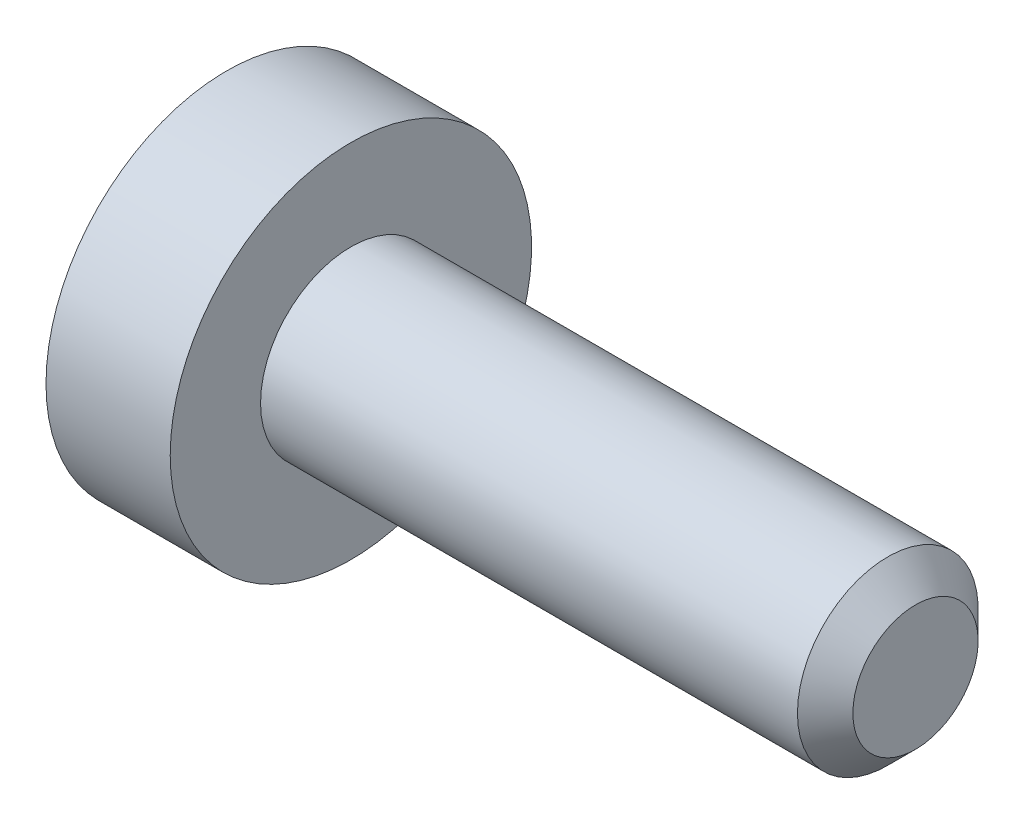
ISO-10303-21;
HEADER;
FILE_DESCRIPTION(('STEP AP214'),'2;1');
FILE_NAME('part.step','',(''),(''),'','','');
FILE_SCHEMA(('AUTOMOTIVE_DESIGN { 1 0 10303 214 1 1 1 1 }'));
ENDSEC;
DATA;
#1=APPLICATION_CONTEXT('core data for automotive mechanical design processes');
#2=APPLICATION_PROTOCOL_DEFINITION('international standard','automotive_design',2000,#1);
#3=PRODUCT_CONTEXT('',#1,'mechanical');
#4=PRODUCT('Part','Part','',(#3));
#5=PRODUCT_RELATED_PRODUCT_CATEGORY('part','',(#4));
#6=PRODUCT_DEFINITION_FORMATION('','',#4);
#7=PRODUCT_DEFINITION_CONTEXT('part definition',#1,'design');
#8=PRODUCT_DEFINITION('design','',#6,#7);
#9=PRODUCT_DEFINITION_SHAPE('','',#8);
#10=(LENGTH_UNIT() NAMED_UNIT(*) SI_UNIT(.MILLI.,.METRE.));
#11=(NAMED_UNIT(*) PLANE_ANGLE_UNIT() SI_UNIT($,.RADIAN.));
#12=(NAMED_UNIT(*) SI_UNIT($,.STERADIAN.) SOLID_ANGLE_UNIT());
#13=UNCERTAINTY_MEASURE_WITH_UNIT(LENGTH_MEASURE(1.E-05),#10,'distance_accuracy_value','');
#14=(GEOMETRIC_REPRESENTATION_CONTEXT(3) GLOBAL_UNCERTAINTY_ASSIGNED_CONTEXT((#13)) GLOBAL_UNIT_ASSIGNED_CONTEXT((#10,
#11,#12)) REPRESENTATION_CONTEXT('',''));
#15=CARTESIAN_POINT('',(0.,0.,0.));
#16=DIRECTION('',(0.,0.,1.));
#17=DIRECTION('',(1.,0.,0.));
#18=AXIS2_PLACEMENT_3D('',#15,#16,#17);
#19=CARTESIAN_POINT('',(-0.97,0.,0.));
#20=DIRECTION('',(-1.,0.,0.));
#21=DIRECTION('',(0.,0.,1.));
#22=AXIS2_PLACEMENT_3D('',#19,#20,#21);
#23=CONICAL_SURFACE('',#22,0.65,0.785398163397449);
#24=CARTESIAN_POINT('',(-1.1,0.,0.));
#25=DIRECTION('',(-1.,0.,0.));
#26=DIRECTION('',(0.,0.,1.));
#27=AXIS2_PLACEMENT_3D('',#24,#25,#26);
#28=CIRCLE('',#27,0.78);
#29=CARTESIAN_POINT('',(-1.1,0.,0.78));
#30=VERTEX_POINT('',#29);
#31=EDGE_CURVE('E227',#30,#30,#28,.T.);
#32=ORIENTED_EDGE('',*,*,#31,.T.);
#33=EDGE_LOOP('',(#32));
#34=FACE_BOUND('',#33,.T.);
#35=CARTESIAN_POINT('',(-1.07067084664318,0.750670820000348,-0.000200000000000034));
#36=CARTESIAN_POINT('',(-1.05777271213806,0.73776480399612,0.0221538754426204));
#37=CARTESIAN_POINT('',(-1.04563050484515,0.724643800275744,0.044880120532612));
#38=CARTESIAN_POINT('',(-1.02339759480874,0.697888312556701,0.0912219846432812));
#39=CARTESIAN_POINT('',(-1.01331927475652,0.684251279339144,0.114842019040595));
#40=CARTESIAN_POINT('',(-0.996056866369887,0.656751052753346,0.162473808706854));
#41=CARTESIAN_POINT('',(-0.988829308462092,0.642894902702,0.186473364593084));
#42=CARTESIAN_POINT('',(-0.97768455194652,0.614884150684731,0.234989410245206));
#43=CARTESIAN_POINT('',(-0.973759052568381,0.600730389323031,0.259504444041877));
#44=CARTESIAN_POINT('',(-0.96877878728122,0.566158679282904,0.319384402335916));
#45=CARTESIAN_POINT('',(-0.969679834739171,0.545659978891344,0.354889192903231));
#46=CARTESIAN_POINT('',(-0.978963911263182,0.505092254718528,0.42515455231799));
#47=CARTESIAN_POINT('',(-0.98735811297617,0.485023918403328,0.459913930439298));
#48=CARTESIAN_POINT('',(-1.00760102845381,0.449779956850421,0.520958262508936));
#49=CARTESIAN_POINT('',(-1.01839377321102,0.434442301170774,0.547523861415083));
#50=CARTESIAN_POINT('',(-1.04270728139612,0.404367956205631,0.599614154899066));
#51=CARTESIAN_POINT('',(-1.0562191709538,0.389629494831163,0.625141918825035));
#52=CARTESIAN_POINT('',(-1.07067084664319,0.375162204919422,0.6502));
#53=B_SPLINE_CURVE_WITH_KNOTS('',3,(#35,#36,#37,#38,#39,#40,#41,#42,#43,#44,#45,#46,#47,#48,#49,
#50,#51,#52),.UNSPECIFIED.,.F.,.F.,(4,2,2,2,2,2,2,2,4),(0.,0.0866236559063428,0.173752711623239,
0.259496442803563,0.345023980281746,0.467267720550118,0.589694037029328,0.687111308755475,
0.784215671813662),.UNSPECIFIED.);
#54=CARTESIAN_POINT('',(-1.07055534994651,0.75055534994651,0.));
#55=VERTEX_POINT('',#54);
#56=CARTESIAN_POINT('',(-1.07055534994651,0.37527767497326,0.65));
#57=VERTEX_POINT('',#56);
#58=EDGE_CURVE('E54',#55,#57,#53,.T.);
#59=ORIENTED_EDGE('',*,*,#58,.T.);
#60=CARTESIAN_POINT('',(-1.34698657134254,-0.795110946797934,0.65));
#61=CARTESIAN_POINT('',(-1.33215114259725,-0.775946306003986,0.65));
#62=CARTESIAN_POINT('',(-1.3174472939133,-0.756680121115909,0.65));
#63=CARTESIAN_POINT('',(-1.28835841074634,-0.717901876989154,0.65));
#64=CARTESIAN_POINT('',(-1.27397345032455,-0.6983897622505,0.65));
#65=CARTESIAN_POINT('',(-1.23117506241516,-0.639135200540149,0.65));
#66=CARTESIAN_POINT('',(-1.20334527350157,-0.598964394147309,0.65));
#67=CARTESIAN_POINT('',(-1.14826198934892,-0.514410757724497,0.65));
#68=CARTESIAN_POINT('',(-1.12116572431861,-0.46992440441247,0.65));
#69=CARTESIAN_POINT('',(-1.0712919728277,-0.378677329688828,0.65));
#70=CARTESIAN_POINT('',(-1.04849990079042,-0.331924989534033,0.65));
#71=CARTESIAN_POINT('',(-1.02060578904515,-0.262171836183639,0.65));
#72=CARTESIAN_POINT('',(-1.01268451768127,-0.240308902088551,0.65));
#73=CARTESIAN_POINT('',(-0.998588372872614,-0.196027368820283,0.65));
#74=CARTESIAN_POINT('',(-0.992413608004518,-0.173608735194612,0.65));
#75=CARTESIAN_POINT('',(-0.977262665972014,-0.106507355653642,0.65));
#76=CARTESIAN_POINT('',(-0.971270973089183,-0.0610734931701748,0.65));
#77=CARTESIAN_POINT('',(-0.96914985793265,0.0279224529824405,0.65));
#78=CARTESIAN_POINT('',(-0.972574981246003,0.0714733819315436,0.65));
#79=CARTESIAN_POINT('',(-0.983733142695104,0.136066508476408,0.65));
#80=CARTESIAN_POINT('',(-0.988531386792264,0.157677342437972,0.65));
#81=CARTESIAN_POINT('',(-0.999890236201741,0.20043000731548,0.65));
#82=CARTESIAN_POINT('',(-1.00645075830175,0.221571860325033,0.65));
#83=CARTESIAN_POINT('',(-1.02901876039986,0.286168508724034,0.65));
#84=CARTESIAN_POINT('',(-1.04751312457459,0.328748789016924,0.65));
#85=CARTESIAN_POINT('',(-1.08868123081028,0.411924938969468,0.65));
#86=CARTESIAN_POINT('',(-1.11136960894874,0.45251320906933,0.65));
#87=CARTESIAN_POINT('',(-1.15821231122604,0.530105416888655,0.65));
#88=CARTESIAN_POINT('',(-1.18223949226305,0.567187443274161,0.65));
#89=CARTESIAN_POINT('',(-1.23177090042578,0.639922078553566,0.65));
#90=CARTESIAN_POINT('',(-1.25726166991636,0.675583795890087,0.65));
#91=CARTESIAN_POINT('',(-1.28322807013493,0.710850416821895,0.65));
#92=B_SPLINE_CURVE_WITH_KNOTS('',3,(#60,#61,#62,#63,#64,#65,#66,#67,#68,#69,#70,#71,#72,#73,#74,
#75,#76,#77,#78,#79,#80,#81,#82,#83,#84,#85,#86,#87,#88,#89,#90,#91),.UNSPECIFIED.,.F.,.F.,(4,2,
2,2,2,2,2,2,2,2,2,2,2,2,2,4),(0.,0.0727056779992604,0.145428068505781,0.291977039828534,
0.44812796117937,0.603739848023543,0.673436680579368,0.743137845090119,0.879622453379847,
1.00976325017061,1.0761088480166,1.14245131366665,1.28132126625575,1.42068531737679,
1.55318895886601,1.68462520727467),.UNSPECIFIED.);
#93=CARTESIAN_POINT('',(-1.07055534994652,-0.37527767497326,0.65));
#94=VERTEX_POINT('',#93);
#95=EDGE_CURVE('E196',#57,#94,#92,.F.);
#96=ORIENTED_EDGE('',*,*,#95,.T.);
#97=CARTESIAN_POINT('',(-1.07067084664319,-0.375162204919422,0.6502));
#98=CARTESIAN_POINT('',(-1.05777271213806,-0.38806822092365,0.627846124557379));
#99=CARTESIAN_POINT('',(-1.04563050484515,-0.401189224644026,0.605119879467387));
#100=CARTESIAN_POINT('',(-1.02339759480874,-0.427944712363071,0.558778015356717));
#101=CARTESIAN_POINT('',(-1.01331927475652,-0.441581745580628,0.535157980959402));
#102=CARTESIAN_POINT('',(-0.996056866369889,-0.469081972166426,0.487526191293143));
#103=CARTESIAN_POINT('',(-0.988829308462093,-0.482938122217773,0.463526635406912));
#104=CARTESIAN_POINT('',(-0.97768455194652,-0.510948874235042,0.415010589754788));
#105=CARTESIAN_POINT('',(-0.973759052568381,-0.525102635596743,0.390495555958116));
#106=CARTESIAN_POINT('',(-0.96877878728122,-0.55967434563687,0.330615597664077));
#107=CARTESIAN_POINT('',(-0.969679834739171,-0.58017304602843,0.295110807096762));
#108=CARTESIAN_POINT('',(-0.978963911263182,-0.620740770201247,0.224845447682002));
#109=CARTESIAN_POINT('',(-0.987358112976169,-0.640809106516447,0.190086069560695));
#110=CARTESIAN_POINT('',(-1.00760102845381,-0.676053068069352,0.129041737491058));
#111=CARTESIAN_POINT('',(-1.01839377321101,-0.691390723748998,0.102476138584913));
#112=CARTESIAN_POINT('',(-1.04270728139611,-0.721465068714141,0.0503858451009323));
#113=CARTESIAN_POINT('',(-1.0562191709538,-0.736203530088608,0.0248580811749638));
#114=CARTESIAN_POINT('',(-1.07067084664318,-0.750670820000348,-0.000200000000000006));
#115=B_SPLINE_CURVE_WITH_KNOTS('',3,(#97,#98,#99,#100,#101,#102,#103,#104,#105,#106,#107,#108,
#109,#110,#111,#112,#113,#114),.UNSPECIFIED.,.F.,.F.,(4,2,2,2,2,2,2,2,4),(0.,0.086623655906345,
0.173752711623244,0.25949644280357,0.345023980281755,0.467267720550128,0.589694037029338,
0.68711130875548,0.784215671813662),.UNSPECIFIED.);
#116=CARTESIAN_POINT('',(-1.07055534994651,-0.75055534994651,0.));
#117=VERTEX_POINT('',#116);
#118=EDGE_CURVE('E140',#94,#117,#115,.T.);
#119=ORIENTED_EDGE('',*,*,#118,.T.);
#120=CARTESIAN_POINT('',(-1.07067084664318,-0.750670820000348,0.000200000000000034));
#121=CARTESIAN_POINT('',(-1.05777271213806,-0.73776480399612,-0.0221538754426204));
#122=CARTESIAN_POINT('',(-1.04563050484515,-0.724643800275744,-0.044880120532612));
#123=CARTESIAN_POINT('',(-1.02339759480874,-0.697888312556701,-0.0912219846432812));
#124=CARTESIAN_POINT('',(-1.01331927475652,-0.684251279339144,-0.114842019040595));
#125=CARTESIAN_POINT('',(-0.996056866369887,-0.656751052753346,-0.162473808706854));
#126=CARTESIAN_POINT('',(-0.988829308462092,-0.642894902702,-0.186473364593084));
#127=CARTESIAN_POINT('',(-0.97768455194652,-0.614884150684731,-0.234989410245206));
#128=CARTESIAN_POINT('',(-0.973759052568381,-0.600730389323031,-0.259504444041877));
#129=CARTESIAN_POINT('',(-0.96877878728122,-0.566158679282904,-0.319384402335916));
#130=CARTESIAN_POINT('',(-0.969679834739171,-0.545659978891344,-0.354889192903231));
#131=CARTESIAN_POINT('',(-0.978963911263182,-0.505092254718528,-0.42515455231799));
#132=CARTESIAN_POINT('',(-0.98735811297617,-0.485023918403328,-0.459913930439298));
#133=CARTESIAN_POINT('',(-1.00760102845381,-0.449779956850421,-0.520958262508936));
#134=CARTESIAN_POINT('',(-1.01839377321102,-0.434442301170774,-0.547523861415083));
#135=CARTESIAN_POINT('',(-1.04270728139612,-0.404367956205631,-0.599614154899066));
#136=CARTESIAN_POINT('',(-1.0562191709538,-0.389629494831163,-0.625141918825035));
#137=CARTESIAN_POINT('',(-1.07067084664319,-0.375162204919422,-0.6502));
#138=B_SPLINE_CURVE_WITH_KNOTS('',3,(#120,#121,#122,#123,#124,#125,#126,#127,#128,#129,#130,
#131,#132,#133,#134,#135,#136,#137),.UNSPECIFIED.,.F.,.F.,(4,2,2,2,2,2,2,2,4),(0.,
0.0866236559063428,0.173752711623239,0.259496442803563,0.345023980281746,0.467267720550118,
0.589694037029328,0.687111308755475,0.784215671813662),.UNSPECIFIED.);
#139=CARTESIAN_POINT('',(-1.07055534994652,-0.37527767497326,-0.65));
#140=VERTEX_POINT('',#139);
#141=EDGE_CURVE('E187',#117,#140,#138,.T.);
#142=ORIENTED_EDGE('',*,*,#141,.T.);
#143=CARTESIAN_POINT('',(-1.34698657134254,-0.795110946797934,-0.65));
#144=CARTESIAN_POINT('',(-1.33215114259725,-0.775946306003986,-0.65));
#145=CARTESIAN_POINT('',(-1.3174472939133,-0.756680121115909,-0.65));
#146=CARTESIAN_POINT('',(-1.28835841074634,-0.717901876989154,-0.65));
#147=CARTESIAN_POINT('',(-1.27397345032455,-0.6983897622505,-0.65));
#148=CARTESIAN_POINT('',(-1.23117506241516,-0.639135200540149,-0.65));
#149=CARTESIAN_POINT('',(-1.20334527350157,-0.598964394147309,-0.65));
#150=CARTESIAN_POINT('',(-1.14826198934892,-0.514410757724497,-0.65));
#151=CARTESIAN_POINT('',(-1.12116572431861,-0.46992440441247,-0.65));
#152=CARTESIAN_POINT('',(-1.0712919728277,-0.378677329688828,-0.65));
#153=CARTESIAN_POINT('',(-1.04849990079042,-0.331924989534033,-0.65));
#154=CARTESIAN_POINT('',(-1.02060578904515,-0.262171836183639,-0.65));
#155=CARTESIAN_POINT('',(-1.01268451768127,-0.240308902088551,-0.65));
#156=CARTESIAN_POINT('',(-0.998588372872614,-0.196027368820283,-0.65));
#157=CARTESIAN_POINT('',(-0.992413608004518,-0.173608735194612,-0.65));
#158=CARTESIAN_POINT('',(-0.977262665972014,-0.106507355653642,-0.65));
#159=CARTESIAN_POINT('',(-0.971270973089183,-0.0610734931701748,-0.65));
#160=CARTESIAN_POINT('',(-0.96914985793265,0.0279224529824405,-0.65));
#161=CARTESIAN_POINT('',(-0.972574981246003,0.0714733819315436,-0.65));
#162=CARTESIAN_POINT('',(-0.983733142695104,0.136066508476408,-0.65));
#163=CARTESIAN_POINT('',(-0.988531386792264,0.157677342437972,-0.65));
#164=CARTESIAN_POINT('',(-0.999890236201741,0.20043000731548,-0.65));
#165=CARTESIAN_POINT('',(-1.00645075830175,0.221571860325033,-0.65));
#166=CARTESIAN_POINT('',(-1.02901876039986,0.286168508724034,-0.65));
#167=CARTESIAN_POINT('',(-1.04751312457459,0.328748789016924,-0.65));
#168=CARTESIAN_POINT('',(-1.08868123081028,0.411924938969468,-0.65));
#169=CARTESIAN_POINT('',(-1.11136960894874,0.45251320906933,-0.65));
#170=CARTESIAN_POINT('',(-1.15821231122604,0.530105416888655,-0.65));
#171=CARTESIAN_POINT('',(-1.18223949226305,0.567187443274161,-0.65));
#172=CARTESIAN_POINT('',(-1.23177090042578,0.639922078553566,-0.65));
#173=CARTESIAN_POINT('',(-1.25726166991636,0.675583795890087,-0.65));
#174=CARTESIAN_POINT('',(-1.28322807013493,0.710850416821895,-0.65));
#175=B_SPLINE_CURVE_WITH_KNOTS('',3,(#143,#144,#145,#146,#147,#148,#149,#150,#151,#152,#153,
#154,#155,#156,#157,#158,#159,#160,#161,#162,#163,#164,#165,#166,#167,#168,#169,#170,#171,#172,
#173,#174),.UNSPECIFIED.,.F.,.F.,(4,2,2,2,2,2,2,2,2,2,2,2,2,2,2,4),(0.,0.0727056779992604,
0.145428068505781,0.291977039828534,0.44812796117937,0.603739848023543,0.673436680579368,
0.743137845090119,0.879622453379847,1.00976325017061,1.0761088480166,1.14245131366665,
1.28132126625575,1.42068531737679,1.55318895886601,1.68462520727467),.UNSPECIFIED.);
#176=CARTESIAN_POINT('',(-1.07055534994652,0.37527767497326,-0.65));
#177=VERTEX_POINT('',#176);
#178=EDGE_CURVE('E182',#140,#177,#175,.T.);
#179=ORIENTED_EDGE('',*,*,#178,.T.);
#180=CARTESIAN_POINT('',(-1.07067084664319,0.375162204919422,-0.6502));
#181=CARTESIAN_POINT('',(-1.05777271213806,0.38806822092365,-0.627846124557379));
#182=CARTESIAN_POINT('',(-1.04563050484515,0.401189224644026,-0.605119879467387));
#183=CARTESIAN_POINT('',(-1.02339759480874,0.427944712363071,-0.558778015356717));
#184=CARTESIAN_POINT('',(-1.01331927475652,0.441581745580628,-0.535157980959402));
#185=CARTESIAN_POINT('',(-0.996056866369889,0.469081972166426,-0.487526191293143));
#186=CARTESIAN_POINT('',(-0.988829308462093,0.482938122217773,-0.463526635406912));
#187=CARTESIAN_POINT('',(-0.97768455194652,0.510948874235042,-0.415010589754788));
#188=CARTESIAN_POINT('',(-0.973759052568381,0.525102635596743,-0.390495555958116));
#189=CARTESIAN_POINT('',(-0.96877878728122,0.55967434563687,-0.330615597664077));
#190=CARTESIAN_POINT('',(-0.969679834739171,0.58017304602843,-0.295110807096762));
#191=CARTESIAN_POINT('',(-0.978963911263182,0.620740770201247,-0.224845447682002));
#192=CARTESIAN_POINT('',(-0.987358112976169,0.640809106516447,-0.190086069560695));
#193=CARTESIAN_POINT('',(-1.00760102845381,0.676053068069352,-0.129041737491058));
#194=CARTESIAN_POINT('',(-1.01839377321101,0.691390723748998,-0.102476138584913));
#195=CARTESIAN_POINT('',(-1.04270728139611,0.721465068714141,-0.0503858451009323));
#196=CARTESIAN_POINT('',(-1.0562191709538,0.736203530088608,-0.0248580811749638));
#197=CARTESIAN_POINT('',(-1.07067084664318,0.750670820000348,0.000200000000000006));
#198=B_SPLINE_CURVE_WITH_KNOTS('',3,(#180,#181,#182,#183,#184,#185,#186,#187,#188,#189,#190,
#191,#192,#193,#194,#195,#196,#197),.UNSPECIFIED.,.F.,.F.,(4,2,2,2,2,2,2,2,4),(0.,
0.086623655906345,0.173752711623244,0.25949644280357,0.345023980281755,0.467267720550128,
0.589694037029338,0.68711130875548,0.784215671813662),.UNSPECIFIED.);
#199=EDGE_CURVE('E143',#177,#55,#198,.T.);
#200=ORIENTED_EDGE('',*,*,#199,.T.);
#201=EDGE_LOOP('',(#59,#96,#119,#142,#179,#200));
#202=FACE_BOUND('',#201,.T.);
#203=ADVANCED_FACE('F39',(#34,#202),#23,.F.);
#204=CARTESIAN_POINT('',(-1.1,0.,0.));
#205=DIRECTION('',(1.,0.,0.));
#206=DIRECTION('',(0.,0.,-1.));
#207=AXIS2_PLACEMENT_3D('',#204,#205,#206);
#208=PLANE('',#207);
#209=CARTESIAN_POINT('',(-1.1,0.,0.));
#210=DIRECTION('',(-1.,0.,0.));
#211=DIRECTION('',(0.,0.,1.));
#212=AXIS2_PLACEMENT_3D('',#209,#210,#211);
#213=CIRCLE('',#212,1.6);
#214=CARTESIAN_POINT('',(-1.1,0.,1.6));
#215=VERTEX_POINT('',#214);
#216=EDGE_CURVE('E233',#215,#215,#213,.T.);
#217=ORIENTED_EDGE('',*,*,#216,.T.);
#218=EDGE_LOOP('',(#217));
#219=FACE_BOUND('',#218,.T.);
#220=ORIENTED_EDGE('',*,*,#31,.F.);
#221=EDGE_LOOP('',(#220));
#222=FACE_BOUND('',#221,.T.);
#223=ADVANCED_FACE('F218',(#219,#222),#208,.F.);
#224=CARTESIAN_POINT('',(5.,0.,0.));
#225=DIRECTION('',(-1.,0.,0.));
#226=DIRECTION('',(0.,0.,1.));
#227=AXIS2_PLACEMENT_3D('',#224,#225,#226);
#228=CYLINDRICAL_SURFACE('',#227,0.8);
#229=CARTESIAN_POINT('',(0.,0.,0.));
#230=DIRECTION('',(-1.,0.,0.));
#231=DIRECTION('',(0.,0.,1.));
#232=AXIS2_PLACEMENT_3D('',#229,#230,#231);
#233=CIRCLE('',#232,0.8);
#234=CARTESIAN_POINT('',(0.,0.,0.8));
#235=VERTEX_POINT('',#234);
#236=EDGE_CURVE('E11',#235,#235,#233,.T.);
#237=ORIENTED_EDGE('',*,*,#236,.F.);
#238=EDGE_LOOP('',(#237));
#239=FACE_BOUND('',#238,.T.);
#240=CARTESIAN_POINT('',(4.7545,0.,0.));
#241=DIRECTION('',(-1.,0.,0.));
#242=DIRECTION('',(0.,0.,1.));
#243=AXIS2_PLACEMENT_3D('',#240,#241,#242);
#244=CIRCLE('',#243,0.800000000000001);
#245=CARTESIAN_POINT('',(4.7545,0.,0.800000000000001));
#246=VERTEX_POINT('',#245);
#247=EDGE_CURVE('E47',#246,#246,#244,.T.);
#248=ORIENTED_EDGE('',*,*,#247,.T.);
#249=EDGE_LOOP('',(#248));
#250=FACE_BOUND('',#249,.T.);
#251=ADVANCED_FACE('F41',(#239,#250),#228,.T.);
#252=CARTESIAN_POINT('',(5.,0.,0.));
#253=DIRECTION('',(-1.,0.,0.));
#254=DIRECTION('',(0.,0.,1.));
#255=AXIS2_PLACEMENT_3D('',#252,#253,#254);
#256=CONICAL_SURFACE('',#255,0.554500000000001,0.785398163397448);
#257=ORIENTED_EDGE('',*,*,#247,.F.);
#258=EDGE_LOOP('',(#257));
#259=FACE_BOUND('',#258,.T.);
#260=CARTESIAN_POINT('',(5.,0.,0.));
#261=DIRECTION('',(-1.,0.,0.));
#262=DIRECTION('',(0.,0.,1.));
#263=AXIS2_PLACEMENT_3D('',#260,#261,#262);
#264=CIRCLE('',#263,0.554500000000001);
#265=CARTESIAN_POINT('',(5.,0.,0.554500000000001));
#266=VERTEX_POINT('',#265);
#267=EDGE_CURVE('E239',#266,#266,#264,.T.);
#268=ORIENTED_EDGE('',*,*,#267,.T.);
#269=EDGE_LOOP('',(#268));
#270=FACE_BOUND('',#269,.T.);
#271=ADVANCED_FACE('F245',(#259,#270),#256,.T.);
#272=CARTESIAN_POINT('',(5.,0.554500000000001,0.));
#273=DIRECTION('',(-1.,0.,0.));
#274=DIRECTION('',(0.,0.,1.));
#275=AXIS2_PLACEMENT_3D('',#272,#273,#274);
#276=PLANE('',#275);
#277=ORIENTED_EDGE('',*,*,#267,.F.);
#278=EDGE_LOOP('',(#277));
#279=FACE_BOUND('',#278,.T.);
#280=ADVANCED_FACE('F248',(#279),#276,.F.);
#281=CARTESIAN_POINT('',(0.,1.6,0.));
#282=DIRECTION('',(-1.,0.,0.));
#283=DIRECTION('',(0.,0.,1.));
#284=AXIS2_PLACEMENT_3D('',#281,#282,#283);
#285=PLANE('',#284);
#286=CARTESIAN_POINT('',(0.,0.,0.));
#287=DIRECTION('',(-1.,0.,0.));
#288=DIRECTION('',(0.,0.,1.));
#289=AXIS2_PLACEMENT_3D('',#286,#287,#288);
#290=CIRCLE('',#289,1.6);
#291=CARTESIAN_POINT('',(0.,0.,1.6));
#292=VERTEX_POINT('',#291);
#293=EDGE_CURVE('E229',#292,#292,#290,.T.);
#294=ORIENTED_EDGE('',*,*,#293,.F.);
#295=EDGE_LOOP('',(#294));
#296=FACE_BOUND('',#295,.T.);
#297=ORIENTED_EDGE('',*,*,#236,.T.);
#298=EDGE_LOOP('',(#297));
#299=FACE_BOUND('',#298,.T.);
#300=ADVANCED_FACE('F252',(#296,#299),#285,.F.);
#301=CARTESIAN_POINT('',(0.,0.,0.));
#302=DIRECTION('',(-1.,0.,0.));
#303=DIRECTION('',(0.,0.,1.));
#304=AXIS2_PLACEMENT_3D('',#301,#302,#303);
#305=CYLINDRICAL_SURFACE('',#304,1.6);
#306=ORIENTED_EDGE('',*,*,#216,.F.);
#307=EDGE_LOOP('',(#306));
#308=FACE_BOUND('',#307,.T.);
#309=ORIENTED_EDGE('',*,*,#293,.T.);
#310=EDGE_LOOP('',(#309));
#311=FACE_BOUND('',#310,.T.);
#312=ADVANCED_FACE('F206',(#308,#311),#305,.T.);
#313=CARTESIAN_POINT('',(0.0999999999999998,0.37527767497326,0.65));
#314=DIRECTION('',(0.,0.,-1.));
#315=DIRECTION('',(-1.,0.,0.));
#316=AXIS2_PLACEMENT_3D('',#313,#314,#315);
#317=PLANE('',#316);
#318=DIRECTION('',(-1.,0.,0.));
#319=VECTOR('',#318,1.);
#320=CARTESIAN_POINT('',(0.0999999999999998,0.37527767497326,0.65));
#321=LINE('',#320,#319);
#322=CARTESIAN_POINT('',(0.0999999999999998,0.37527767497326,0.65));
#323=VERTEX_POINT('',#322);
#324=EDGE_CURVE('E417',#323,#57,#321,.T.);
#325=ORIENTED_EDGE('',*,*,#324,.F.);
#326=DIRECTION('',(0.,-1.,0.));
#327=VECTOR('',#326,1.);
#328=CARTESIAN_POINT('',(0.0999999999999998,0.37527767497326,0.65));
#329=LINE('',#328,#327);
#330=CARTESIAN_POINT('',(0.0999999999999998,0.,0.65));
#331=VERTEX_POINT('',#330);
#332=EDGE_CURVE('E123',#323,#331,#329,.T.);
#333=ORIENTED_EDGE('',*,*,#332,.T.);
#334=CARTESIAN_POINT('',(0.0999999999999998,-0.37527767497326,0.65));
#335=VERTEX_POINT('',#334);
#336=EDGE_CURVE('E115',#331,#335,#329,.T.);
#337=ORIENTED_EDGE('',*,*,#336,.T.);
#338=DIRECTION('',(-1.,0.,0.));
#339=VECTOR('',#338,1.);
#340=CARTESIAN_POINT('',(0.0999999999999998,-0.37527767497326,0.65));
#341=LINE('',#340,#339);
#342=EDGE_CURVE('E121',#335,#94,#341,.T.);
#343=ORIENTED_EDGE('',*,*,#342,.T.);
#344=ORIENTED_EDGE('',*,*,#95,.F.);
#345=EDGE_LOOP('',(#325,#333,#337,#343,#344));
#346=FACE_BOUND('',#345,.T.);
#347=ADVANCED_FACE('F118',(#346),#317,.T.);
#348=CARTESIAN_POINT('',(0.0999999999999998,-0.37527767497326,0.65));
#349=DIRECTION('',(0.,0.866025403784443,-0.499999999999993));
#350=DIRECTION('',(0.,0.499999999999993,0.866025403784442));
#351=AXIS2_PLACEMENT_3D('',#348,#349,#350);
#352=PLANE('',#351);
#353=ORIENTED_EDGE('',*,*,#342,.F.);
#354=DIRECTION('',(0.,-0.499999999999993,-0.866025403784442));
#355=VECTOR('',#354,1.);
#356=CARTESIAN_POINT('',(0.0999999999999998,-0.37527767497326,0.65));
#357=LINE('',#356,#355);
#358=CARTESIAN_POINT('',(0.0999999999999998,-0.562916512459887,0.324999999999996));
#359=VERTEX_POINT('',#358);
#360=EDGE_CURVE('E128',#335,#359,#357,.T.);
#361=ORIENTED_EDGE('',*,*,#360,.T.);
#362=CARTESIAN_POINT('',(0.0999999999999998,-0.75055534994651,0.));
#363=VERTEX_POINT('',#362);
#364=EDGE_CURVE('E135',#359,#363,#357,.T.);
#365=ORIENTED_EDGE('',*,*,#364,.T.);
#366=DIRECTION('',(-1.,0.,0.));
#367=VECTOR('',#366,1.);
#368=CARTESIAN_POINT('',(0.0999999999999998,-0.75055534994651,0.));
#369=LINE('',#368,#367);
#370=EDGE_CURVE('E141',#363,#117,#369,.T.);
#371=ORIENTED_EDGE('',*,*,#370,.T.);
#372=ORIENTED_EDGE('',*,*,#118,.F.);
#373=EDGE_LOOP('',(#353,#361,#365,#371,#372));
#374=FACE_BOUND('',#373,.T.);
#375=ADVANCED_FACE('F138',(#374),#352,.T.);
#376=CARTESIAN_POINT('',(0.0999999999999998,-0.75055534994651,0.));
#377=DIRECTION('',(0.,0.866025403784443,0.499999999999993));
#378=DIRECTION('',(0.,-0.499999999999993,0.866025403784442));
#379=AXIS2_PLACEMENT_3D('',#376,#377,#378);
#380=PLANE('',#379);
#381=ORIENTED_EDGE('',*,*,#370,.F.);
#382=DIRECTION('',(0.,0.499999999999993,-0.866025403784442));
#383=VECTOR('',#382,1.);
#384=CARTESIAN_POINT('',(0.0999999999999998,-0.75055534994651,0.));
#385=LINE('',#384,#383);
#386=CARTESIAN_POINT('',(0.1,-0.562916512459888,-0.324999999999996));
#387=VERTEX_POINT('',#386);
#388=EDGE_CURVE('E62',#363,#387,#385,.T.);
#389=ORIENTED_EDGE('',*,*,#388,.T.);
#390=CARTESIAN_POINT('',(0.0999999999999998,-0.37527767497326,-0.65));
#391=VERTEX_POINT('',#390);
#392=EDGE_CURVE('E134',#387,#391,#385,.T.);
#393=ORIENTED_EDGE('',*,*,#392,.T.);
#394=DIRECTION('',(-1.,0.,0.));
#395=VECTOR('',#394,1.);
#396=CARTESIAN_POINT('',(0.0999999999999998,-0.37527767497326,-0.65));
#397=LINE('',#396,#395);
#398=EDGE_CURVE('E145',#391,#140,#397,.T.);
#399=ORIENTED_EDGE('',*,*,#398,.T.);
#400=ORIENTED_EDGE('',*,*,#141,.F.);
#401=EDGE_LOOP('',(#381,#389,#393,#399,#400));
#402=FACE_BOUND('',#401,.T.);
#403=ADVANCED_FACE('F178',(#402),#380,.T.);
#404=CARTESIAN_POINT('',(0.0999999999999998,-0.37527767497326,-0.65));
#405=DIRECTION('',(0.,0.,1.));
#406=DIRECTION('',(1.,0.,0.));
#407=AXIS2_PLACEMENT_3D('',#404,#405,#406);
#408=PLANE('',#407);
#409=ORIENTED_EDGE('',*,*,#398,.F.);
#410=DIRECTION('',(0.,1.,0.));
#411=VECTOR('',#410,1.);
#412=CARTESIAN_POINT('',(0.0999999999999998,-0.37527767497326,-0.65));
#413=LINE('',#412,#411);
#414=CARTESIAN_POINT('',(0.0999999999999998,0.,-0.65));
#415=VERTEX_POINT('',#414);
#416=EDGE_CURVE('E430',#391,#415,#413,.T.);
#417=ORIENTED_EDGE('',*,*,#416,.T.);
#418=CARTESIAN_POINT('',(0.0999999999999998,0.37527767497326,-0.65));
#419=VERTEX_POINT('',#418);
#420=EDGE_CURVE('E431',#415,#419,#413,.T.);
#421=ORIENTED_EDGE('',*,*,#420,.T.);
#422=DIRECTION('',(-1.,0.,0.));
#423=VECTOR('',#422,1.);
#424=CARTESIAN_POINT('',(0.0999999999999998,0.37527767497326,-0.65));
#425=LINE('',#424,#423);
#426=EDGE_CURVE('E423',#419,#177,#425,.T.);
#427=ORIENTED_EDGE('',*,*,#426,.T.);
#428=ORIENTED_EDGE('',*,*,#178,.F.);
#429=EDGE_LOOP('',(#409,#417,#421,#427,#428));
#430=FACE_BOUND('',#429,.T.);
#431=ADVANCED_FACE('F173',(#430),#408,.T.);
#432=CARTESIAN_POINT('',(0.0999999999999998,0.37527767497326,-0.65));
#433=DIRECTION('',(0.,-0.866025403784443,0.499999999999993));
#434=DIRECTION('',(0.,-0.499999999999993,-0.866025403784442));
#435=AXIS2_PLACEMENT_3D('',#432,#433,#434);
#436=PLANE('',#435);
#437=ORIENTED_EDGE('',*,*,#426,.F.);
#438=DIRECTION('',(0.,0.499999999999993,0.866025403784442));
#439=VECTOR('',#438,1.);
#440=CARTESIAN_POINT('',(0.0999999999999998,0.37527767497326,-0.65));
#441=LINE('',#440,#439);
#442=CARTESIAN_POINT('',(0.0999999999999998,0.562916512459887,-0.324999999999996));
#443=VERTEX_POINT('',#442);
#444=EDGE_CURVE('E412',#419,#443,#441,.T.);
#445=ORIENTED_EDGE('',*,*,#444,.T.);
#446=CARTESIAN_POINT('',(0.0999999999999998,0.75055534994651,0.));
#447=VERTEX_POINT('',#446);
#448=EDGE_CURVE('E409',#443,#447,#441,.T.);
#449=ORIENTED_EDGE('',*,*,#448,.T.);
#450=DIRECTION('',(-1.,0.,0.));
#451=VECTOR('',#450,1.);
#452=CARTESIAN_POINT('',(0.0999999999999998,0.75055534994651,0.));
#453=LINE('',#452,#451);
#454=EDGE_CURVE('E416',#447,#55,#453,.T.);
#455=ORIENTED_EDGE('',*,*,#454,.T.);
#456=ORIENTED_EDGE('',*,*,#199,.F.);
#457=EDGE_LOOP('',(#437,#445,#449,#455,#456));
#458=FACE_BOUND('',#457,.T.);
#459=ADVANCED_FACE('F167',(#458),#436,.T.);
#460=CARTESIAN_POINT('',(0.0999999999999998,0.75055534994651,0.));
#461=DIRECTION('',(0.,-0.866025403784443,-0.499999999999993));
#462=DIRECTION('',(0.,0.499999999999993,-0.866025403784442));
#463=AXIS2_PLACEMENT_3D('',#460,#461,#462);
#464=PLANE('',#463);
#465=ORIENTED_EDGE('',*,*,#454,.F.);
#466=DIRECTION('',(0.,-0.499999999999993,0.866025403784442));
#467=VECTOR('',#466,1.);
#468=CARTESIAN_POINT('',(0.0999999999999998,0.75055534994651,0.));
#469=LINE('',#468,#467);
#470=CARTESIAN_POINT('',(0.0999999999999998,0.562916512459887,0.324999999999996));
#471=VERTEX_POINT('',#470);
#472=EDGE_CURVE('E408',#447,#471,#469,.T.);
#473=ORIENTED_EDGE('',*,*,#472,.T.);
#474=EDGE_CURVE('E411',#471,#323,#469,.T.);
#475=ORIENTED_EDGE('',*,*,#474,.T.);
#476=ORIENTED_EDGE('',*,*,#324,.T.);
#477=ORIENTED_EDGE('',*,*,#58,.F.);
#478=EDGE_LOOP('',(#465,#473,#475,#476,#477));
#479=FACE_BOUND('',#478,.T.);
#480=ADVANCED_FACE('F162',(#479),#464,.T.);
#481=CARTESIAN_POINT('',(0.0999999999999998,0.,0.));
#482=DIRECTION('',(1.,0.,0.));
#483=DIRECTION('',(0.,0.,-1.));
#484=AXIS2_PLACEMENT_3D('',#481,#482,#483);
#485=PLANE('',#484);
#486=CARTESIAN_POINT('',(0.1,0.,0.));
#487=DIRECTION('',(-1.,0.,0.));
#488=DIRECTION('',(0.,0.,1.));
#489=AXIS2_PLACEMENT_3D('',#486,#487,#488);
#490=CIRCLE('',#489,0.65);
#491=EDGE_CURVE('E401',#443,#415,#490,.T.);
#492=ORIENTED_EDGE('',*,*,#491,.F.);
#493=ORIENTED_EDGE('',*,*,#444,.F.);
#494=ORIENTED_EDGE('',*,*,#420,.F.);
#495=EDGE_LOOP('',(#492,#493,#494));
#496=FACE_BOUND('',#495,.T.);
#497=ADVANCED_FACE('F166',(#496),#485,.F.);
#498=EDGE_CURVE('E235',#471,#443,#490,.T.);
#499=ORIENTED_EDGE('',*,*,#498,.F.);
#500=ORIENTED_EDGE('',*,*,#472,.F.);
#501=ORIENTED_EDGE('',*,*,#448,.F.);
#502=EDGE_LOOP('',(#499,#500,#501));
#503=FACE_BOUND('',#502,.T.);
#504=ADVANCED_FACE('F350',(#503),#485,.F.);
#505=EDGE_CURVE('E230',#331,#471,#490,.T.);
#506=ORIENTED_EDGE('',*,*,#505,.F.);
#507=ORIENTED_EDGE('',*,*,#332,.F.);
#508=ORIENTED_EDGE('',*,*,#474,.F.);
#509=EDGE_LOOP('',(#506,#507,#508));
#510=FACE_BOUND('',#509,.T.);
#511=ADVANCED_FACE('F359',(#510),#485,.F.);
#512=EDGE_CURVE('E130',#359,#331,#490,.T.);
#513=ORIENTED_EDGE('',*,*,#512,.F.);
#514=ORIENTED_EDGE('',*,*,#360,.F.);
#515=ORIENTED_EDGE('',*,*,#336,.F.);
#516=EDGE_LOOP('',(#513,#514,#515));
#517=FACE_BOUND('',#516,.T.);
#518=ADVANCED_FACE('F129',(#517),#485,.F.);
#519=EDGE_CURVE('E396',#387,#359,#490,.T.);
#520=ORIENTED_EDGE('',*,*,#519,.F.);
#521=ORIENTED_EDGE('',*,*,#388,.F.);
#522=ORIENTED_EDGE('',*,*,#364,.F.);
#523=EDGE_LOOP('',(#520,#521,#522));
#524=FACE_BOUND('',#523,.T.);
#525=ADVANCED_FACE('F213',(#524),#485,.F.);
#526=EDGE_CURVE('E398',#415,#387,#490,.T.);
#527=ORIENTED_EDGE('',*,*,#526,.F.);
#528=ORIENTED_EDGE('',*,*,#416,.F.);
#529=ORIENTED_EDGE('',*,*,#392,.F.);
#530=EDGE_LOOP('',(#527,#528,#529));
#531=FACE_BOUND('',#530,.T.);
#532=ADVANCED_FACE('F169',(#531),#485,.F.);
#533=CARTESIAN_POINT('',(0.47527767497326,0.,0.));
#534=DIRECTION('',(-1.,0.,0.));
#535=DIRECTION('',(0.,0.,1.));
#536=AXIS2_PLACEMENT_3D('',#533,#534,#535);
#537=CONICAL_SURFACE('',#536,0.,1.04719755119659);
#538=ORIENTED_EDGE('',*,*,#505,.T.);
#539=ORIENTED_EDGE('',*,*,#498,.T.);
#540=ORIENTED_EDGE('',*,*,#491,.T.);
#541=ORIENTED_EDGE('',*,*,#526,.T.);
#542=ORIENTED_EDGE('',*,*,#519,.T.);
#543=ORIENTED_EDGE('',*,*,#512,.T.);
#544=EDGE_LOOP('',(#538,#539,#540,#541,#542,#543));
#545=FACE_BOUND('',#544,.T.);
#546=CARTESIAN_POINT('',(0.47527767497326,0.,0.));
#547=VERTEX_POINT('',#546);
#548=VERTEX_LOOP('',#547);
#549=FACE_BOUND('',#548,.T.);
#550=ADVANCED_FACE('F207',(#545,#549),#537,.F.);
#551=CLOSED_SHELL('',(#203,#223,#251,#271,#280,#300,#312,#347,#375,#403,#431,#459,#480,#497,
#504,#511,#518,#525,#532,#550));
#552=MANIFOLD_SOLID_BREP('B2',#551);
#553=ADVANCED_BREP_SHAPE_REPRESENTATION('',(#18,#552),#14);
#554=SHAPE_DEFINITION_REPRESENTATION(#9,#553);
ENDSEC;
END-ISO-10303-21;
